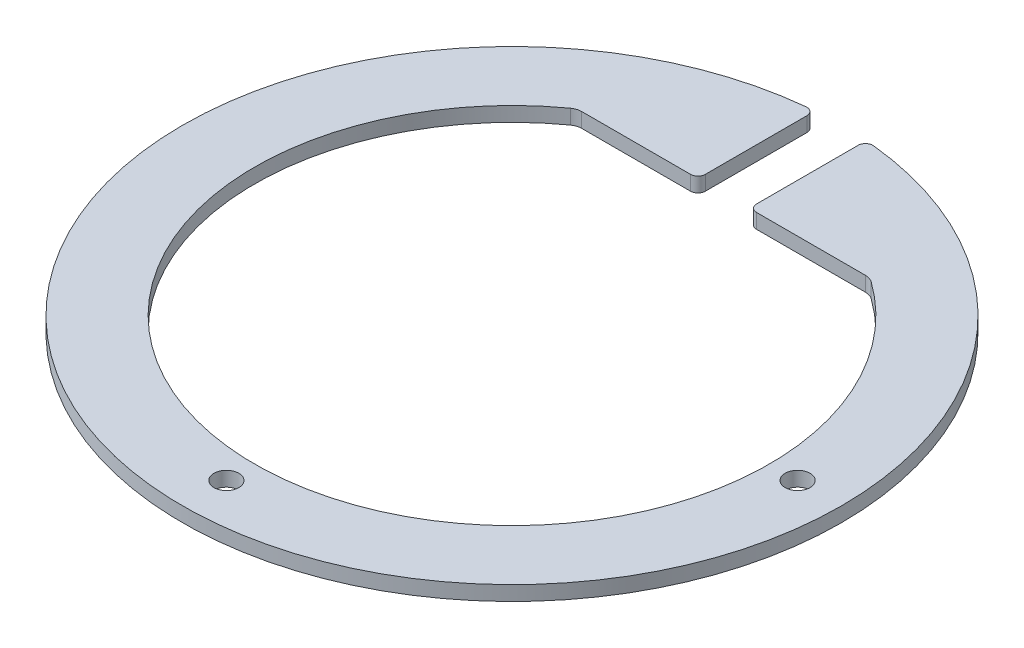
ISO-10303-21;
HEADER;
FILE_DESCRIPTION(('STEP AP214'),'2;1');
FILE_NAME('part.step','',(''),(''),'','','');
FILE_SCHEMA(('AUTOMOTIVE_DESIGN { 1 0 10303 214 1 1 1 1 }'));
ENDSEC;
DATA;
#1=APPLICATION_CONTEXT('core data for automotive mechanical design processes');
#2=APPLICATION_PROTOCOL_DEFINITION('international standard','automotive_design',2000,#1);
#3=PRODUCT_CONTEXT('',#1,'mechanical');
#4=PRODUCT('Part','Part','',(#3));
#5=PRODUCT_RELATED_PRODUCT_CATEGORY('part','',(#4));
#6=PRODUCT_DEFINITION_FORMATION('','',#4);
#7=PRODUCT_DEFINITION_CONTEXT('part definition',#1,'design');
#8=PRODUCT_DEFINITION('design','',#6,#7);
#9=PRODUCT_DEFINITION_SHAPE('','',#8);
#10=(LENGTH_UNIT() NAMED_UNIT(*) SI_UNIT(.MILLI.,.METRE.));
#11=(NAMED_UNIT(*) PLANE_ANGLE_UNIT() SI_UNIT($,.RADIAN.));
#12=(NAMED_UNIT(*) SI_UNIT($,.STERADIAN.) SOLID_ANGLE_UNIT());
#13=UNCERTAINTY_MEASURE_WITH_UNIT(LENGTH_MEASURE(1.E-05),#10,'distance_accuracy_value','');
#14=(GEOMETRIC_REPRESENTATION_CONTEXT(3) GLOBAL_UNCERTAINTY_ASSIGNED_CONTEXT((#13)) GLOBAL_UNIT_ASSIGNED_CONTEXT((#10,
#11,#12)) REPRESENTATION_CONTEXT('',''));
#15=CARTESIAN_POINT('',(0.,0.,0.));
#16=DIRECTION('',(0.,0.,1.));
#17=DIRECTION('',(1.,0.,0.));
#18=AXIS2_PLACEMENT_3D('',#15,#16,#17);
#19=CARTESIAN_POINT('',(0.,2.,-1.01307850997046E-12));
#20=DIRECTION('',(0.,-1.,0.));
#21=DIRECTION('',(0.,0.,-1.));
#22=AXIS2_PLACEMENT_3D('',#19,#20,#21);
#23=CYLINDRICAL_SURFACE('',#22,44.999999999999);
#24=CARTESIAN_POINT('',(0.,0.,-1.01307850997046E-12));
#25=DIRECTION('',(0.,1.,0.));
#26=DIRECTION('',(0.,0.,1.));
#27=AXIS2_PLACEMENT_3D('',#24,#25,#26);
#28=CIRCLE('',#27,44.999999999999);
#29=CARTESIAN_POINT('',(-4.60227272727273,0.,-44.7640378623712));
#30=VERTEX_POINT('',#29);
#31=CARTESIAN_POINT('',(4.60227272727273,0.,-44.7640378623712));
#32=VERTEX_POINT('',#31);
#33=EDGE_CURVE('E155',#30,#32,#28,.T.);
#34=ORIENTED_EDGE('',*,*,#33,.T.);
#35=DIRECTION('',(0.,-1.,0.));
#36=VECTOR('',#35,1.);
#37=CARTESIAN_POINT('',(4.60227272727273,2.,-44.7640378623712));
#38=LINE('',#37,#36);
#39=CARTESIAN_POINT('',(4.60227272727273,2.,-44.7640378623712));
#40=VERTEX_POINT('',#39);
#41=EDGE_CURVE('E132',#32,#40,#38,.F.);
#42=ORIENTED_EDGE('',*,*,#41,.T.);
#43=CARTESIAN_POINT('',(0.,2.,-1.01307850997046E-12));
#44=DIRECTION('',(0.,1.,0.));
#45=DIRECTION('',(0.,0.,1.));
#46=AXIS2_PLACEMENT_3D('',#43,#44,#45);
#47=CIRCLE('',#46,44.999999999999);
#48=CARTESIAN_POINT('',(-4.60227272727273,2.,-44.7640378623712));
#49=VERTEX_POINT('',#48);
#50=EDGE_CURVE('E171',#49,#40,#47,.T.);
#51=ORIENTED_EDGE('',*,*,#50,.F.);
#52=DIRECTION('',(0.,-1.,0.));
#53=VECTOR('',#52,1.);
#54=CARTESIAN_POINT('',(-4.60227272727273,2.,-44.7640378623712));
#55=LINE('',#54,#53);
#56=EDGE_CURVE('E137',#49,#30,#55,.T.);
#57=ORIENTED_EDGE('',*,*,#56,.T.);
#58=EDGE_LOOP('',(#34,#42,#51,#57));
#59=FACE_BOUND('',#58,.T.);
#60=ADVANCED_FACE('F39',(#59),#23,.T.);
#61=CARTESIAN_POINT('',(3.5,2.,-28.89));
#62=DIRECTION('',(1.,0.,0.));
#63=DIRECTION('',(0.,0.,-1.));
#64=AXIS2_PLACEMENT_3D('',#61,#62,#63);
#65=PLANE('',#64);
#66=DIRECTION('',(0.,0.,1.));
#67=VECTOR('',#66,1.);
#68=CARTESIAN_POINT('',(3.5,2.,-28.89));
#69=LINE('',#68,#67);
#70=CARTESIAN_POINT('',(3.5,2.,-43.7692814654296));
#71=VERTEX_POINT('',#70);
#72=CARTESIAN_POINT('',(3.5,2.,-29.89));
#73=VERTEX_POINT('',#72);
#74=EDGE_CURVE('E147',#71,#73,#69,.T.);
#75=ORIENTED_EDGE('',*,*,#74,.F.);
#76=DIRECTION('',(0.,-1.,0.));
#77=VECTOR('',#76,1.);
#78=CARTESIAN_POINT('',(3.5,2.,-43.7692814654296));
#79=LINE('',#78,#77);
#80=CARTESIAN_POINT('',(3.5,0.,-43.7692814654296));
#81=VERTEX_POINT('',#80);
#82=EDGE_CURVE('E131',#71,#81,#79,.T.);
#83=ORIENTED_EDGE('',*,*,#82,.T.);
#84=DIRECTION('',(0.,0.,1.));
#85=VECTOR('',#84,1.);
#86=CARTESIAN_POINT('',(3.5,0.,-28.89));
#87=LINE('',#86,#85);
#88=CARTESIAN_POINT('',(3.5,0.,-29.89));
#89=VERTEX_POINT('',#88);
#90=EDGE_CURVE('E144',#81,#89,#87,.T.);
#91=ORIENTED_EDGE('',*,*,#90,.T.);
#92=DIRECTION('',(0.,-1.,0.));
#93=VECTOR('',#92,1.);
#94=CARTESIAN_POINT('',(3.5,2.,-29.89));
#95=LINE('',#94,#93);
#96=EDGE_CURVE('E149',#89,#73,#95,.F.);
#97=ORIENTED_EDGE('',*,*,#96,.T.);
#98=EDGE_LOOP('',(#75,#83,#91,#97));
#99=FACE_BOUND('',#98,.T.);
#100=ADVANCED_FACE('F143',(#99),#65,.F.);
#101=CARTESIAN_POINT('',(3.5,2.,-28.89));
#102=DIRECTION('',(0.,0.,-1.));
#103=DIRECTION('',(-1.,0.,0.));
#104=AXIS2_PLACEMENT_3D('',#101,#102,#103);
#105=PLANE('',#104);
#106=DIRECTION('',(1.,0.,0.));
#107=VECTOR('',#106,1.);
#108=CARTESIAN_POINT('',(3.5,0.,-28.89));
#109=LINE('',#108,#107);
#110=CARTESIAN_POINT('',(4.5,0.,-28.89));
#111=VERTEX_POINT('',#110);
#112=CARTESIAN_POINT('',(19.3651922790468,0.,-28.89));
#113=VERTEX_POINT('',#112);
#114=EDGE_CURVE('E154',#111,#113,#109,.T.);
#115=ORIENTED_EDGE('',*,*,#114,.T.);
#116=DIRECTION('',(0.,1.,0.));
#117=VECTOR('',#116,1.);
#118=CARTESIAN_POINT('',(19.3651922790468,2.,-28.89));
#119=LINE('',#118,#117);
#120=CARTESIAN_POINT('',(19.3651922790468,2.,-28.89));
#121=VERTEX_POINT('',#120);
#122=EDGE_CURVE('E205',#113,#121,#119,.T.);
#123=ORIENTED_EDGE('',*,*,#122,.T.);
#124=DIRECTION('',(1.,0.,0.));
#125=VECTOR('',#124,1.);
#126=CARTESIAN_POINT('',(3.5,2.,-28.89));
#127=LINE('',#126,#125);
#128=CARTESIAN_POINT('',(4.5,2.,-28.89));
#129=VERTEX_POINT('',#128);
#130=EDGE_CURVE('E226',#129,#121,#127,.T.);
#131=ORIENTED_EDGE('',*,*,#130,.F.);
#132=DIRECTION('',(0.,-1.,0.));
#133=VECTOR('',#132,1.);
#134=CARTESIAN_POINT('',(4.5,2.,-28.89));
#135=LINE('',#134,#133);
#136=EDGE_CURVE('E194',#129,#111,#135,.T.);
#137=ORIENTED_EDGE('',*,*,#136,.T.);
#138=EDGE_LOOP('',(#115,#123,#131,#137));
#139=FACE_BOUND('',#138,.T.);
#140=ADVANCED_FACE('F291',(#139),#105,.F.);
#141=CARTESIAN_POINT('',(0.,2.,0.));
#142=DIRECTION('',(0.,-1.,0.));
#143=DIRECTION('',(0.,0.,-1.));
#144=AXIS2_PLACEMENT_3D('',#141,#142,#143);
#145=CYLINDRICAL_SURFACE('',#144,35.1373319988869);
#146=CARTESIAN_POINT('',(0.,2.,0.));
#147=DIRECTION('',(0.,-1.,0.));
#148=DIRECTION('',(0.,0.,1.));
#149=AXIS2_PLACEMENT_3D('',#146,#147,#148);
#150=CIRCLE('',#149,35.1373319988869);
#151=CARTESIAN_POINT('',(20.5339763126978,2.,-28.5129429696334));
#152=VERTEX_POINT('',#151);
#153=CARTESIAN_POINT('',(-20.5339763126978,2.,-28.5129429696334));
#154=VERTEX_POINT('',#153);
#155=EDGE_CURVE('E223',#152,#154,#150,.T.);
#156=ORIENTED_EDGE('',*,*,#155,.F.);
#157=DIRECTION('',(0.,-1.,0.));
#158=VECTOR('',#157,1.);
#159=CARTESIAN_POINT('',(20.5339763126978,2.,-28.5129429696334));
#160=LINE('',#159,#158);
#161=CARTESIAN_POINT('',(20.5339763126978,0.,-28.5129429696334));
#162=VERTEX_POINT('',#161);
#163=EDGE_CURVE('E202',#152,#162,#160,.T.);
#164=ORIENTED_EDGE('',*,*,#163,.T.);
#165=CARTESIAN_POINT('',(0.,0.,0.));
#166=DIRECTION('',(0.,-1.,0.));
#167=DIRECTION('',(0.,0.,1.));
#168=AXIS2_PLACEMENT_3D('',#165,#166,#167);
#169=CIRCLE('',#168,35.1373319988869);
#170=CARTESIAN_POINT('',(-20.5339763126978,0.,-28.5129429696334));
#171=VERTEX_POINT('',#170);
#172=EDGE_CURVE('E158',#162,#171,#169,.T.);
#173=ORIENTED_EDGE('',*,*,#172,.T.);
#174=DIRECTION('',(0.,-1.,0.));
#175=VECTOR('',#174,1.);
#176=CARTESIAN_POINT('',(-20.5339763126978,2.,-28.5129429696334));
#177=LINE('',#176,#175);
#178=EDGE_CURVE('E200',#171,#154,#177,.F.);
#179=ORIENTED_EDGE('',*,*,#178,.T.);
#180=EDGE_LOOP('',(#156,#164,#173,#179));
#181=FACE_BOUND('',#180,.T.);
#182=ADVANCED_FACE('F216',(#181),#145,.F.);
#183=CARTESIAN_POINT('',(-20.,2.,-28.89));
#184=DIRECTION('',(0.,0.,-1.));
#185=DIRECTION('',(-1.,0.,0.));
#186=AXIS2_PLACEMENT_3D('',#183,#184,#185);
#187=PLANE('',#186);
#188=DIRECTION('',(1.,0.,0.));
#189=VECTOR('',#188,1.);
#190=CARTESIAN_POINT('',(-20.,2.,-28.89));
#191=LINE('',#190,#189);
#192=CARTESIAN_POINT('',(-19.3651922790468,2.,-28.89));
#193=VERTEX_POINT('',#192);
#194=CARTESIAN_POINT('',(-4.5,2.,-28.89));
#195=VERTEX_POINT('',#194);
#196=EDGE_CURVE('E220',#193,#195,#191,.T.);
#197=ORIENTED_EDGE('',*,*,#196,.F.);
#198=DIRECTION('',(0.,1.,0.));
#199=VECTOR('',#198,1.);
#200=CARTESIAN_POINT('',(-19.3651922790468,0.,-28.89));
#201=LINE('',#200,#199);
#202=CARTESIAN_POINT('',(-19.3651922790468,0.,-28.89));
#203=VERTEX_POINT('',#202);
#204=EDGE_CURVE('E207',#193,#203,#201,.F.);
#205=ORIENTED_EDGE('',*,*,#204,.T.);
#206=DIRECTION('',(1.,0.,0.));
#207=VECTOR('',#206,1.);
#208=CARTESIAN_POINT('',(-20.,0.,-28.89));
#209=LINE('',#208,#207);
#210=CARTESIAN_POINT('',(-4.5,0.,-28.89));
#211=VERTEX_POINT('',#210);
#212=EDGE_CURVE('E166',#203,#211,#209,.T.);
#213=ORIENTED_EDGE('',*,*,#212,.T.);
#214=DIRECTION('',(0.,-1.,0.));
#215=VECTOR('',#214,1.);
#216=CARTESIAN_POINT('',(-4.5,2.,-28.89));
#217=LINE('',#216,#215);
#218=EDGE_CURVE('E197',#211,#195,#217,.F.);
#219=ORIENTED_EDGE('',*,*,#218,.T.);
#220=EDGE_LOOP('',(#197,#205,#213,#219));
#221=FACE_BOUND('',#220,.T.);
#222=ADVANCED_FACE('F219',(#221),#187,.F.);
#223=CARTESIAN_POINT('',(-3.5,2.,-28.89));
#224=DIRECTION('',(-1.,0.,0.));
#225=DIRECTION('',(0.,0.,1.));
#226=AXIS2_PLACEMENT_3D('',#223,#224,#225);
#227=PLANE('',#226);
#228=DIRECTION('',(0.,0.,-1.));
#229=VECTOR('',#228,1.);
#230=CARTESIAN_POINT('',(-3.5,0.,-28.89));
#231=LINE('',#230,#229);
#232=CARTESIAN_POINT('',(-3.5,0.,-29.89));
#233=VERTEX_POINT('',#232);
#234=CARTESIAN_POINT('',(-3.5,0.,-43.7692814654296));
#235=VERTEX_POINT('',#234);
#236=EDGE_CURVE('E168',#233,#235,#231,.T.);
#237=ORIENTED_EDGE('',*,*,#236,.T.);
#238=DIRECTION('',(0.,-1.,0.));
#239=VECTOR('',#238,1.);
#240=CARTESIAN_POINT('',(-3.5,2.,-43.7692814654296));
#241=LINE('',#240,#239);
#242=CARTESIAN_POINT('',(-3.5,2.,-43.7692814654296));
#243=VERTEX_POINT('',#242);
#244=EDGE_CURVE('E192',#235,#243,#241,.F.);
#245=ORIENTED_EDGE('',*,*,#244,.T.);
#246=DIRECTION('',(0.,0.,-1.));
#247=VECTOR('',#246,1.);
#248=CARTESIAN_POINT('',(-3.5,2.,-28.89));
#249=LINE('',#248,#247);
#250=CARTESIAN_POINT('',(-3.5,2.,-29.89));
#251=VERTEX_POINT('',#250);
#252=EDGE_CURVE('E172',#251,#243,#249,.T.);
#253=ORIENTED_EDGE('',*,*,#252,.F.);
#254=DIRECTION('',(0.,-1.,0.));
#255=VECTOR('',#254,1.);
#256=CARTESIAN_POINT('',(-3.5,2.,-29.89));
#257=LINE('',#256,#255);
#258=EDGE_CURVE('E189',#251,#233,#257,.T.);
#259=ORIENTED_EDGE('',*,*,#258,.T.);
#260=EDGE_LOOP('',(#237,#245,#253,#259));
#261=FACE_BOUND('',#260,.T.);
#262=ADVANCED_FACE('F258',(#261),#227,.F.);
#263=CARTESIAN_POINT('',(0.,2.,-1.01307850997046E-12));
#264=DIRECTION('',(0.,1.,0.));
#265=DIRECTION('',(0.,0.,1.));
#266=AXIS2_PLACEMENT_3D('',#263,#264,#265);
#267=PLANE('',#266);
#268=CARTESIAN_POINT('',(38.999999999999,2.,0.));
#269=DIRECTION('',(0.,1.,0.));
#270=DIRECTION('',(0.,0.,1.));
#271=AXIS2_PLACEMENT_3D('',#268,#269,#270);
#272=CIRCLE('',#271,1.7);
#273=CARTESIAN_POINT('',(38.999999999999,2.,1.7));
#274=VERTEX_POINT('',#273);
#275=EDGE_CURVE('E240',#274,#274,#272,.T.);
#276=ORIENTED_EDGE('',*,*,#275,.F.);
#277=EDGE_LOOP('',(#276));
#278=FACE_BOUND('',#277,.T.);
#279=CARTESIAN_POINT('',(0.,2.,38.999999999998));
#280=DIRECTION('',(0.,1.,0.));
#281=DIRECTION('',(0.,0.,1.));
#282=AXIS2_PLACEMENT_3D('',#279,#280,#281);
#283=CIRCLE('',#282,1.7);
#284=CARTESIAN_POINT('',(0.,2.,40.699999999998));
#285=VERTEX_POINT('',#284);
#286=EDGE_CURVE('E237',#285,#285,#283,.T.);
#287=ORIENTED_EDGE('',*,*,#286,.F.);
#288=EDGE_LOOP('',(#287));
#289=FACE_BOUND('',#288,.T.);
#290=ORIENTED_EDGE('',*,*,#50,.T.);
#291=CARTESIAN_POINT('',(4.5,2.,-43.7692814654296));
#292=DIRECTION('',(0.,1.,0.));
#293=DIRECTION('',(0.,0.,1.));
#294=AXIS2_PLACEMENT_3D('',#291,#292,#293);
#295=CIRCLE('',#294,1.);
#296=EDGE_CURVE('E187',#40,#71,#295,.T.);
#297=ORIENTED_EDGE('',*,*,#296,.T.);
#298=ORIENTED_EDGE('',*,*,#74,.T.);
#299=CARTESIAN_POINT('',(4.5,2.,-29.89));
#300=DIRECTION('',(0.,1.,0.));
#301=DIRECTION('',(0.,0.,1.));
#302=AXIS2_PLACEMENT_3D('',#299,#300,#301);
#303=CIRCLE('',#302,1.);
#304=EDGE_CURVE('E183',#73,#129,#303,.T.);
#305=ORIENTED_EDGE('',*,*,#304,.T.);
#306=ORIENTED_EDGE('',*,*,#130,.T.);
#307=CARTESIAN_POINT('',(19.3651922790468,2.,-26.89));
#308=DIRECTION('',(0.,1.,0.));
#309=DIRECTION('',(0.,0.,1.));
#310=AXIS2_PLACEMENT_3D('',#307,#308,#309);
#311=CIRCLE('',#310,2.);
#312=EDGE_CURVE('E211',#121,#152,#311,.F.);
#313=ORIENTED_EDGE('',*,*,#312,.T.);
#314=ORIENTED_EDGE('',*,*,#155,.T.);
#315=CARTESIAN_POINT('',(-19.3651922790468,2.,-26.89));
#316=DIRECTION('',(0.,1.,0.));
#317=DIRECTION('',(0.,0.,1.));
#318=AXIS2_PLACEMENT_3D('',#315,#316,#317);
#319=CIRCLE('',#318,2.);
#320=EDGE_CURVE('E11',#154,#193,#319,.F.);
#321=ORIENTED_EDGE('',*,*,#320,.T.);
#322=ORIENTED_EDGE('',*,*,#196,.T.);
#323=CARTESIAN_POINT('',(-4.5,2.,-29.89));
#324=DIRECTION('',(0.,1.,0.));
#325=DIRECTION('',(0.,0.,1.));
#326=AXIS2_PLACEMENT_3D('',#323,#324,#325);
#327=CIRCLE('',#326,1.);
#328=EDGE_CURVE('E181',#195,#251,#327,.T.);
#329=ORIENTED_EDGE('',*,*,#328,.T.);
#330=ORIENTED_EDGE('',*,*,#252,.T.);
#331=CARTESIAN_POINT('',(-4.5,2.,-43.7692814654296));
#332=DIRECTION('',(0.,1.,0.));
#333=DIRECTION('',(0.,0.,1.));
#334=AXIS2_PLACEMENT_3D('',#331,#332,#333);
#335=CIRCLE('',#334,1.);
#336=EDGE_CURVE('E185',#243,#49,#335,.T.);
#337=ORIENTED_EDGE('',*,*,#336,.T.);
#338=EDGE_LOOP('',(#290,#297,#298,#305,#306,#313,#314,#321,#322,#329,#330,#337));
#339=FACE_BOUND('',#338,.T.);
#340=ADVANCED_FACE('F255',(#278,#289,#339),#267,.T.);
#341=CARTESIAN_POINT('',(0.,0.,-1.01307850997046E-12));
#342=DIRECTION('',(0.,1.,0.));
#343=DIRECTION('',(0.,0.,1.));
#344=AXIS2_PLACEMENT_3D('',#341,#342,#343);
#345=PLANE('',#344);
#346=CARTESIAN_POINT('',(38.999999999999,0.,0.));
#347=DIRECTION('',(0.,1.,0.));
#348=DIRECTION('',(0.,0.,1.));
#349=AXIS2_PLACEMENT_3D('',#346,#347,#348);
#350=CIRCLE('',#349,1.7);
#351=CARTESIAN_POINT('',(38.999999999999,0.,1.7));
#352=VERTEX_POINT('',#351);
#353=EDGE_CURVE('E160',#352,#352,#350,.T.);
#354=ORIENTED_EDGE('',*,*,#353,.T.);
#355=EDGE_LOOP('',(#354));
#356=FACE_BOUND('',#355,.T.);
#357=CARTESIAN_POINT('',(0.,0.,38.999999999998));
#358=DIRECTION('',(0.,1.,0.));
#359=DIRECTION('',(0.,0.,1.));
#360=AXIS2_PLACEMENT_3D('',#357,#358,#359);
#361=CIRCLE('',#360,1.7);
#362=CARTESIAN_POINT('',(0.,0.,40.699999999998));
#363=VERTEX_POINT('',#362);
#364=EDGE_CURVE('E234',#363,#363,#361,.T.);
#365=ORIENTED_EDGE('',*,*,#364,.T.);
#366=EDGE_LOOP('',(#365));
#367=FACE_BOUND('',#366,.T.);
#368=ORIENTED_EDGE('',*,*,#90,.F.);
#369=CARTESIAN_POINT('',(4.5,0.,-43.7692814654296));
#370=DIRECTION('',(0.,1.,0.));
#371=DIRECTION('',(0.,0.,1.));
#372=AXIS2_PLACEMENT_3D('',#369,#370,#371);
#373=CIRCLE('',#372,1.);
#374=EDGE_CURVE('E127',#81,#32,#373,.F.);
#375=ORIENTED_EDGE('',*,*,#374,.T.);
#376=ORIENTED_EDGE('',*,*,#33,.F.);
#377=CARTESIAN_POINT('',(-4.5,0.,-43.7692814654296));
#378=DIRECTION('',(0.,1.,0.));
#379=DIRECTION('',(0.,0.,1.));
#380=AXIS2_PLACEMENT_3D('',#377,#378,#379);
#381=CIRCLE('',#380,1.);
#382=EDGE_CURVE('E138',#30,#235,#381,.F.);
#383=ORIENTED_EDGE('',*,*,#382,.T.);
#384=ORIENTED_EDGE('',*,*,#236,.F.);
#385=CARTESIAN_POINT('',(-4.5,0.,-29.89));
#386=DIRECTION('',(0.,1.,0.));
#387=DIRECTION('',(0.,0.,1.));
#388=AXIS2_PLACEMENT_3D('',#385,#386,#387);
#389=CIRCLE('',#388,1.);
#390=EDGE_CURVE('E148',#233,#211,#389,.F.);
#391=ORIENTED_EDGE('',*,*,#390,.T.);
#392=ORIENTED_EDGE('',*,*,#212,.F.);
#393=CARTESIAN_POINT('',(-19.3651922790468,0.,-26.89));
#394=DIRECTION('',(0.,1.,0.));
#395=DIRECTION('',(0.,0.,1.));
#396=AXIS2_PLACEMENT_3D('',#393,#394,#395);
#397=CIRCLE('',#396,2.);
#398=EDGE_CURVE('E47',#203,#171,#397,.T.);
#399=ORIENTED_EDGE('',*,*,#398,.T.);
#400=ORIENTED_EDGE('',*,*,#172,.F.);
#401=CARTESIAN_POINT('',(19.3651922790468,0.,-26.89));
#402=DIRECTION('',(0.,1.,0.));
#403=DIRECTION('',(0.,0.,1.));
#404=AXIS2_PLACEMENT_3D('',#401,#402,#403);
#405=CIRCLE('',#404,2.);
#406=EDGE_CURVE('E209',#162,#113,#405,.T.);
#407=ORIENTED_EDGE('',*,*,#406,.T.);
#408=ORIENTED_EDGE('',*,*,#114,.F.);
#409=CARTESIAN_POINT('',(4.5,0.,-29.89));
#410=DIRECTION('',(0.,1.,0.));
#411=DIRECTION('',(0.,0.,1.));
#412=AXIS2_PLACEMENT_3D('',#409,#410,#411);
#413=CIRCLE('',#412,1.);
#414=EDGE_CURVE('E153',#111,#89,#413,.F.);
#415=ORIENTED_EDGE('',*,*,#414,.T.);
#416=EDGE_LOOP('',(#368,#375,#376,#383,#384,#391,#392,#399,#400,#407,#408,#415));
#417=FACE_BOUND('',#416,.T.);
#418=ADVANCED_FACE('F151',(#356,#367,#417),#345,.F.);
#419=CARTESIAN_POINT('',(0.,0.,38.999999999998));
#420=DIRECTION('',(0.,1.,0.));
#421=DIRECTION('',(0.,0.,1.));
#422=AXIS2_PLACEMENT_3D('',#419,#420,#421);
#423=CYLINDRICAL_SURFACE('',#422,1.7);
#424=ORIENTED_EDGE('',*,*,#364,.F.);
#425=EDGE_LOOP('',(#424));
#426=FACE_BOUND('',#425,.T.);
#427=ORIENTED_EDGE('',*,*,#286,.T.);
#428=EDGE_LOOP('',(#427));
#429=FACE_BOUND('',#428,.T.);
#430=ADVANCED_FACE('F251',(#426,#429),#423,.F.);
#431=CARTESIAN_POINT('',(38.999999999999,0.,0.));
#432=DIRECTION('',(0.,1.,0.));
#433=DIRECTION('',(0.,0.,1.));
#434=AXIS2_PLACEMENT_3D('',#431,#432,#433);
#435=CYLINDRICAL_SURFACE('',#434,1.7);
#436=ORIENTED_EDGE('',*,*,#353,.F.);
#437=EDGE_LOOP('',(#436));
#438=FACE_BOUND('',#437,.T.);
#439=ORIENTED_EDGE('',*,*,#275,.T.);
#440=EDGE_LOOP('',(#439));
#441=FACE_BOUND('',#440,.T.);
#442=ADVANCED_FACE('F248',(#438,#441),#435,.F.);
#443=CARTESIAN_POINT('',(4.5,2.,-43.7692814654296));
#444=DIRECTION('',(0.,-1.,0.));
#445=DIRECTION('',(0.,0.,-1.));
#446=AXIS2_PLACEMENT_3D('',#443,#444,#445);
#447=CYLINDRICAL_SURFACE('',#446,1.);
#448=ORIENTED_EDGE('',*,*,#296,.F.);
#449=ORIENTED_EDGE('',*,*,#41,.F.);
#450=ORIENTED_EDGE('',*,*,#374,.F.);
#451=ORIENTED_EDGE('',*,*,#82,.F.);
#452=EDGE_LOOP('',(#448,#449,#450,#451));
#453=FACE_BOUND('',#452,.T.);
#454=ADVANCED_FACE('F130',(#453),#447,.T.);
#455=CARTESIAN_POINT('',(-4.5,2.,-43.7692814654296));
#456=DIRECTION('',(0.,-1.,0.));
#457=DIRECTION('',(0.,0.,-1.));
#458=AXIS2_PLACEMENT_3D('',#455,#456,#457);
#459=CYLINDRICAL_SURFACE('',#458,1.);
#460=ORIENTED_EDGE('',*,*,#336,.F.);
#461=ORIENTED_EDGE('',*,*,#244,.F.);
#462=ORIENTED_EDGE('',*,*,#382,.F.);
#463=ORIENTED_EDGE('',*,*,#56,.F.);
#464=EDGE_LOOP('',(#460,#461,#462,#463));
#465=FACE_BOUND('',#464,.T.);
#466=ADVANCED_FACE('F266',(#465),#459,.T.);
#467=CARTESIAN_POINT('',(4.5,2.,-29.89));
#468=DIRECTION('',(0.,-1.,0.));
#469=DIRECTION('',(0.,0.,-1.));
#470=AXIS2_PLACEMENT_3D('',#467,#468,#469);
#471=CYLINDRICAL_SURFACE('',#470,1.);
#472=ORIENTED_EDGE('',*,*,#304,.F.);
#473=ORIENTED_EDGE('',*,*,#96,.F.);
#474=ORIENTED_EDGE('',*,*,#414,.F.);
#475=ORIENTED_EDGE('',*,*,#136,.F.);
#476=EDGE_LOOP('',(#472,#473,#474,#475));
#477=FACE_BOUND('',#476,.T.);
#478=ADVANCED_FACE('F276',(#477),#471,.T.);
#479=CARTESIAN_POINT('',(-4.5,2.,-29.89));
#480=DIRECTION('',(0.,-1.,0.));
#481=DIRECTION('',(0.,0.,-1.));
#482=AXIS2_PLACEMENT_3D('',#479,#480,#481);
#483=CYLINDRICAL_SURFACE('',#482,1.);
#484=ORIENTED_EDGE('',*,*,#328,.F.);
#485=ORIENTED_EDGE('',*,*,#218,.F.);
#486=ORIENTED_EDGE('',*,*,#390,.F.);
#487=ORIENTED_EDGE('',*,*,#258,.F.);
#488=EDGE_LOOP('',(#484,#485,#486,#487));
#489=FACE_BOUND('',#488,.T.);
#490=ADVANCED_FACE('F273',(#489),#483,.T.);
#491=CARTESIAN_POINT('',(19.3651922790468,2.,-26.89));
#492=DIRECTION('',(0.,-1.,0.));
#493=DIRECTION('',(0.,0.,-1.));
#494=AXIS2_PLACEMENT_3D('',#491,#492,#493);
#495=CYLINDRICAL_SURFACE('',#494,2.);
#496=ORIENTED_EDGE('',*,*,#312,.F.);
#497=ORIENTED_EDGE('',*,*,#122,.F.);
#498=ORIENTED_EDGE('',*,*,#406,.F.);
#499=ORIENTED_EDGE('',*,*,#163,.F.);
#500=EDGE_LOOP('',(#496,#497,#498,#499));
#501=FACE_BOUND('',#500,.T.);
#502=ADVANCED_FACE('F275',(#501),#495,.F.);
#503=CARTESIAN_POINT('',(-19.3651922790468,2.,-26.89));
#504=DIRECTION('',(0.,-1.,0.));
#505=DIRECTION('',(0.,0.,-1.));
#506=AXIS2_PLACEMENT_3D('',#503,#504,#505);
#507=CYLINDRICAL_SURFACE('',#506,2.);
#508=ORIENTED_EDGE('',*,*,#320,.F.);
#509=ORIENTED_EDGE('',*,*,#178,.F.);
#510=ORIENTED_EDGE('',*,*,#398,.F.);
#511=ORIENTED_EDGE('',*,*,#204,.F.);
#512=EDGE_LOOP('',(#508,#509,#510,#511));
#513=FACE_BOUND('',#512,.T.);
#514=ADVANCED_FACE('F41',(#513),#507,.F.);
#515=CLOSED_SHELL('',(#60,#100,#140,#182,#222,#262,#340,#418,#430,#442,#454,#466,#478,#490,#502,#514));
#516=MANIFOLD_SOLID_BREP('B2',#515);
#517=ADVANCED_BREP_SHAPE_REPRESENTATION('',(#18,#516),#14);
#518=SHAPE_DEFINITION_REPRESENTATION(#9,#517);
ENDSEC;
END-ISO-10303-21;
